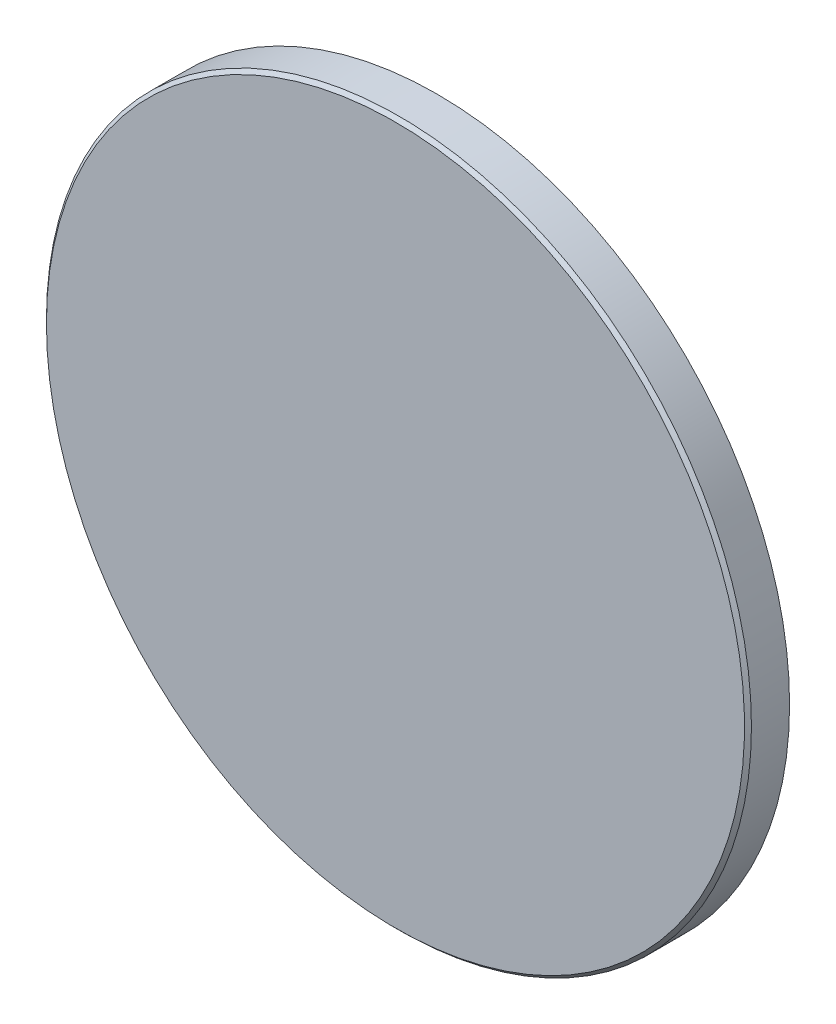
ISO-10303-21;
HEADER;
FILE_DESCRIPTION(('STEP AP214'),'2;1');
FILE_NAME('part.step','',(''),(''),'','','');
FILE_SCHEMA(('AUTOMOTIVE_DESIGN { 1 0 10303 214 1 1 1 1 }'));
ENDSEC;
DATA;
#1=APPLICATION_CONTEXT('core data for automotive mechanical design processes');
#2=APPLICATION_PROTOCOL_DEFINITION('international standard','automotive_design',2000,#1);
#3=PRODUCT_CONTEXT('',#1,'mechanical');
#4=PRODUCT('Part','Part','',(#3));
#5=PRODUCT_RELATED_PRODUCT_CATEGORY('part','',(#4));
#6=PRODUCT_DEFINITION_FORMATION('','',#4);
#7=PRODUCT_DEFINITION_CONTEXT('part definition',#1,'design');
#8=PRODUCT_DEFINITION('design','',#6,#7);
#9=PRODUCT_DEFINITION_SHAPE('','',#8);
#10=(LENGTH_UNIT() NAMED_UNIT(*) SI_UNIT(.MILLI.,.METRE.));
#11=(NAMED_UNIT(*) PLANE_ANGLE_UNIT() SI_UNIT($,.RADIAN.));
#12=(NAMED_UNIT(*) SI_UNIT($,.STERADIAN.) SOLID_ANGLE_UNIT());
#13=UNCERTAINTY_MEASURE_WITH_UNIT(LENGTH_MEASURE(1.E-05),#10,'distance_accuracy_value','');
#14=(GEOMETRIC_REPRESENTATION_CONTEXT(3) GLOBAL_UNCERTAINTY_ASSIGNED_CONTEXT((#13)) GLOBAL_UNIT_ASSIGNED_CONTEXT((#10,
#11,#12)) REPRESENTATION_CONTEXT('',''));
#15=CARTESIAN_POINT('',(0.,0.,0.));
#16=DIRECTION('',(0.,0.,1.));
#17=DIRECTION('',(1.,0.,0.));
#18=AXIS2_PLACEMENT_3D('',#15,#16,#17);
#19=CARTESIAN_POINT('',(0.,0.,0.));
#20=DIRECTION('',(0.,0.,-1.));
#21=DIRECTION('',(-1.,0.,0.));
#22=AXIS2_PLACEMENT_3D('',#19,#20,#21);
#23=PLANE('',#22);
#24=CARTESIAN_POINT('',(0.,0.,0.));
#25=DIRECTION('',(0.,0.,-1.));
#26=DIRECTION('',(-1.,0.,0.));
#27=AXIS2_PLACEMENT_3D('',#24,#25,#26);
#28=CIRCLE('',#27,25.15);
#29=CARTESIAN_POINT('',(-25.15,0.,0.));
#30=VERTEX_POINT('',#29);
#31=EDGE_CURVE('E20',#30,#30,#28,.F.);
#32=ORIENTED_EDGE('',*,*,#31,.T.);
#33=EDGE_LOOP('',(#32));
#34=FACE_BOUND('',#33,.T.);
#35=ADVANCED_FACE('F13',(#34),#23,.F.);
#36=CARTESIAN_POINT('',(0.,0.,0.));
#37=DIRECTION('',(0.,0.,1.));
#38=DIRECTION('',(1.,0.,0.));
#39=AXIS2_PLACEMENT_3D('',#36,#37,#38);
#40=CYLINDRICAL_SURFACE('',#39,25.4);
#41=CARTESIAN_POINT('',(0.,0.,-0.249999999999986));
#42=DIRECTION('',(0.,0.,-1.));
#43=DIRECTION('',(-1.,0.,0.));
#44=AXIS2_PLACEMENT_3D('',#41,#42,#43);
#45=CIRCLE('',#44,25.4);
#46=CARTESIAN_POINT('',(-25.4,0.,-0.249999999999986));
#47=VERTEX_POINT('',#46);
#48=EDGE_CURVE('E9',#47,#47,#45,.T.);
#49=ORIENTED_EDGE('',*,*,#48,.T.);
#50=EDGE_LOOP('',(#49));
#51=FACE_BOUND('',#50,.T.);
#52=CARTESIAN_POINT('',(0.,0.,-2.99741477993198));
#53=DIRECTION('',(0.,0.,1.));
#54=DIRECTION('',(1.,0.,0.));
#55=AXIS2_PLACEMENT_3D('',#52,#53,#54);
#56=CIRCLE('',#55,25.4);
#57=CARTESIAN_POINT('',(25.4,0.,-2.99741477993198));
#58=VERTEX_POINT('',#57);
#59=EDGE_CURVE('E24',#58,#58,#56,.T.);
#60=ORIENTED_EDGE('',*,*,#59,.T.);
#61=EDGE_LOOP('',(#60));
#62=FACE_BOUND('',#61,.T.);
#63=ADVANCED_FACE('F31',(#51,#62),#40,.T.);
#64=CARTESIAN_POINT('',(0.,0.,124.65));
#65=DIRECTION('',(0.,0.,1.));
#66=DIRECTION('',(0.,1.,0.));
#67=AXIS2_PLACEMENT_3D('',#64,#65,#66);
#68=SPHERICAL_SURFACE('',#67,130.15);
#69=ORIENTED_EDGE('',*,*,#59,.F.);
#70=EDGE_LOOP('',(#69));
#71=FACE_BOUND('',#70,.T.);
#72=ADVANCED_FACE('F33',(#71),#68,.T.);
#73=CARTESIAN_POINT('',(0.,0.,0.));
#74=DIRECTION('',(0.,0.,-1.));
#75=DIRECTION('',(-1.,0.,0.));
#76=AXIS2_PLACEMENT_3D('',#73,#74,#75);
#77=CONICAL_SURFACE('',#76,25.15,0.785398163397455);
#78=ORIENTED_EDGE('',*,*,#48,.F.);
#79=EDGE_LOOP('',(#78));
#80=FACE_BOUND('',#79,.T.);
#81=ORIENTED_EDGE('',*,*,#31,.F.);
#82=EDGE_LOOP('',(#81));
#83=FACE_BOUND('',#82,.T.);
#84=ADVANCED_FACE('F15',(#80,#83),#77,.T.);
#85=CLOSED_SHELL('',(#35,#63,#72,#84));
#86=MANIFOLD_SOLID_BREP('B1',#85);
#87=ADVANCED_BREP_SHAPE_REPRESENTATION('',(#18,#86),#14);
#88=SHAPE_DEFINITION_REPRESENTATION(#9,#87);
ENDSEC;
END-ISO-10303-21;
